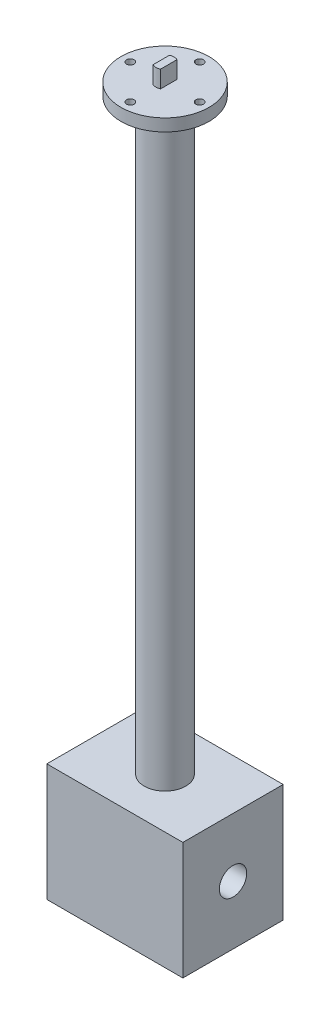
ISO-10303-21;
HEADER;
FILE_DESCRIPTION(('STEP AP214'),'2;1');
FILE_NAME('part.step','',(''),(''),'','','');
FILE_SCHEMA(('AUTOMOTIVE_DESIGN { 1 0 10303 214 1 1 1 1 }'));
ENDSEC;
DATA;
#1=APPLICATION_CONTEXT('core data for automotive mechanical design processes');
#2=APPLICATION_PROTOCOL_DEFINITION('international standard','automotive_design',2000,#1);
#3=PRODUCT_CONTEXT('',#1,'mechanical');
#4=PRODUCT('Part','Part','',(#3));
#5=PRODUCT_RELATED_PRODUCT_CATEGORY('part','',(#4));
#6=PRODUCT_DEFINITION_FORMATION('','',#4);
#7=PRODUCT_DEFINITION_CONTEXT('part definition',#1,'design');
#8=PRODUCT_DEFINITION('design','',#6,#7);
#9=PRODUCT_DEFINITION_SHAPE('','',#8);
#10=(LENGTH_UNIT() NAMED_UNIT(*) SI_UNIT(.MILLI.,.METRE.));
#11=(NAMED_UNIT(*) PLANE_ANGLE_UNIT() SI_UNIT($,.RADIAN.));
#12=(NAMED_UNIT(*) SI_UNIT($,.STERADIAN.) SOLID_ANGLE_UNIT());
#13=UNCERTAINTY_MEASURE_WITH_UNIT(LENGTH_MEASURE(1.E-05),#10,'distance_accuracy_value','');
#14=(GEOMETRIC_REPRESENTATION_CONTEXT(3) GLOBAL_UNCERTAINTY_ASSIGNED_CONTEXT((#13)) GLOBAL_UNIT_ASSIGNED_CONTEXT((#10,
#11,#12)) REPRESENTATION_CONTEXT('',''));
#15=CARTESIAN_POINT('',(0.,0.,0.));
#16=DIRECTION('',(0.,0.,1.));
#17=DIRECTION('',(1.,0.,0.));
#18=AXIS2_PLACEMENT_3D('',#15,#16,#17);
#19=CARTESIAN_POINT('',(0.,6.35,0.));
#20=DIRECTION('',(0.,1.,0.));
#21=DIRECTION('',(0.,0.,1.));
#22=AXIS2_PLACEMENT_3D('',#19,#20,#21);
#23=PLANE('',#22);
#24=CARTESIAN_POINT('',(18.,6.35,-1.88539992297529E-13));
#25=DIRECTION('',(0.,1.,0.));
#26=DIRECTION('',(0.,0.,1.));
#27=AXIS2_PLACEMENT_3D('',#24,#25,#26);
#28=CIRCLE('',#27,1.984375);
#29=CARTESIAN_POINT('',(18.,6.35,1.98437499999981));
#30=VERTEX_POINT('',#29);
#31=EDGE_CURVE('E132',#30,#30,#28,.T.);
#32=ORIENTED_EDGE('',*,*,#31,.F.);
#33=EDGE_LOOP('',(#32));
#34=FACE_BOUND('',#33,.T.);
#35=CARTESIAN_POINT('',(0.,6.35,18.));
#36=DIRECTION('',(0.,1.,0.));
#37=DIRECTION('',(0.,0.,1.));
#38=AXIS2_PLACEMENT_3D('',#35,#36,#37);
#39=CIRCLE('',#38,1.984375);
#40=CARTESIAN_POINT('',(0.,6.35,19.984375));
#41=VERTEX_POINT('',#40);
#42=EDGE_CURVE('E146',#41,#41,#39,.T.);
#43=ORIENTED_EDGE('',*,*,#42,.F.);
#44=EDGE_LOOP('',(#43));
#45=FACE_BOUND('',#44,.T.);
#46=CARTESIAN_POINT('',(-18.,6.35,0.));
#47=DIRECTION('',(0.,1.,0.));
#48=DIRECTION('',(0.,0.,1.));
#49=AXIS2_PLACEMENT_3D('',#46,#47,#48);
#50=CIRCLE('',#49,1.984375);
#51=CARTESIAN_POINT('',(-18.,6.35,1.98437500000006));
#52=VERTEX_POINT('',#51);
#53=EDGE_CURVE('E154',#52,#52,#50,.T.);
#54=ORIENTED_EDGE('',*,*,#53,.F.);
#55=EDGE_LOOP('',(#54));
#56=FACE_BOUND('',#55,.T.);
#57=CARTESIAN_POINT('',(0.,6.35,-18.));
#58=DIRECTION('',(0.,1.,0.));
#59=DIRECTION('',(0.,0.,1.));
#60=AXIS2_PLACEMENT_3D('',#57,#58,#59);
#61=CIRCLE('',#60,1.984375);
#62=CARTESIAN_POINT('',(0.,6.35,-16.015625));
#63=VERTEX_POINT('',#62);
#64=EDGE_CURVE('E162',#63,#63,#61,.T.);
#65=ORIENTED_EDGE('',*,*,#64,.F.);
#66=EDGE_LOOP('',(#65));
#67=FACE_BOUND('',#66,.T.);
#68=CARTESIAN_POINT('',(0.,6.35,0.));
#69=DIRECTION('',(0.,1.,0.));
#70=DIRECTION('',(0.,0.,1.));
#71=AXIS2_PLACEMENT_3D('',#68,#69,#70);
#72=CIRCLE('',#71,22.86);
#73=CARTESIAN_POINT('',(0.,6.35,22.86));
#74=VERTEX_POINT('',#73);
#75=EDGE_CURVE('E210',#74,#74,#72,.T.);
#76=ORIENTED_EDGE('',*,*,#75,.T.);
#77=EDGE_LOOP('',(#76));
#78=FACE_BOUND('',#77,.T.);
#79=CARTESIAN_POINT('',(0.,6.35,0.));
#80=DIRECTION('',(0.,1.,0.));
#81=DIRECTION('',(0.,0.,1.));
#82=AXIS2_PLACEMENT_3D('',#79,#80,#81);
#83=CIRCLE('',#82,4.699);
#84=CARTESIAN_POINT('',(1.9685,6.35,-4.26680310654242));
#85=VERTEX_POINT('',#84);
#86=CARTESIAN_POINT('',(-1.9685,6.35,-4.26680310654242));
#87=VERTEX_POINT('',#86);
#88=EDGE_CURVE('E187',#85,#87,#83,.T.);
#89=ORIENTED_EDGE('',*,*,#88,.F.);
#90=DIRECTION('',(0.,0.,1.));
#91=VECTOR('',#90,1.);
#92=CARTESIAN_POINT('',(1.9685,6.35,0.));
#93=LINE('',#92,#91);
#94=CARTESIAN_POINT('',(1.9685,6.35,4.26680310654242));
#95=VERTEX_POINT('',#94);
#96=EDGE_CURVE('E55',#85,#95,#93,.T.);
#97=ORIENTED_EDGE('',*,*,#96,.T.);
#98=CARTESIAN_POINT('',(-1.9685,6.35,4.26680310654241));
#99=VERTEX_POINT('',#98);
#100=EDGE_CURVE('E60',#99,#95,#83,.T.);
#101=ORIENTED_EDGE('',*,*,#100,.F.);
#102=DIRECTION('',(0.,0.,1.));
#103=VECTOR('',#102,1.);
#104=CARTESIAN_POINT('',(-1.9685,6.35,0.));
#105=LINE('',#104,#103);
#106=EDGE_CURVE('E191',#87,#99,#105,.T.);
#107=ORIENTED_EDGE('',*,*,#106,.F.);
#108=EDGE_LOOP('',(#89,#97,#101,#107));
#109=FACE_BOUND('',#108,.T.);
#110=ADVANCED_FACE('F39',(#34,#45,#56,#67,#78,#109),#23,.T.);
#111=CARTESIAN_POINT('',(0.,6.35,0.));
#112=DIRECTION('',(0.,-1.,0.));
#113=DIRECTION('',(0.,0.,-1.));
#114=AXIS2_PLACEMENT_3D('',#111,#112,#113);
#115=CYLINDRICAL_SURFACE('',#114,22.86);
#116=ORIENTED_EDGE('',*,*,#75,.F.);
#117=EDGE_LOOP('',(#116));
#118=FACE_BOUND('',#117,.T.);
#119=CARTESIAN_POINT('',(0.,0.,0.));
#120=DIRECTION('',(0.,1.,0.));
#121=DIRECTION('',(0.,0.,1.));
#122=AXIS2_PLACEMENT_3D('',#119,#120,#121);
#123=CIRCLE('',#122,22.86);
#124=CARTESIAN_POINT('',(0.,0.,22.86));
#125=VERTEX_POINT('',#124);
#126=EDGE_CURVE('E209',#125,#125,#123,.T.);
#127=ORIENTED_EDGE('',*,*,#126,.T.);
#128=EDGE_LOOP('',(#127));
#129=FACE_BOUND('',#128,.T.);
#130=ADVANCED_FACE('F237',(#118,#129),#115,.T.);
#131=CARTESIAN_POINT('',(0.,0.,0.));
#132=DIRECTION('',(0.,1.,0.));
#133=DIRECTION('',(0.,0.,1.));
#134=AXIS2_PLACEMENT_3D('',#131,#132,#133);
#135=PLANE('',#134);
#136=CARTESIAN_POINT('',(18.,0.,-1.88539992297529E-13));
#137=DIRECTION('',(0.,1.,0.));
#138=DIRECTION('',(0.,0.,1.));
#139=AXIS2_PLACEMENT_3D('',#136,#137,#138);
#140=CIRCLE('',#139,1.984375);
#141=CARTESIAN_POINT('',(18.,0.,1.98437499999981));
#142=VERTEX_POINT('',#141);
#143=EDGE_CURVE('E137',#142,#142,#140,.T.);
#144=ORIENTED_EDGE('',*,*,#143,.T.);
#145=EDGE_LOOP('',(#144));
#146=FACE_BOUND('',#145,.T.);
#147=CARTESIAN_POINT('',(0.,0.,18.));
#148=DIRECTION('',(0.,1.,0.));
#149=DIRECTION('',(0.,0.,1.));
#150=AXIS2_PLACEMENT_3D('',#147,#148,#149);
#151=CIRCLE('',#150,1.984375);
#152=CARTESIAN_POINT('',(0.,0.,19.984375));
#153=VERTEX_POINT('',#152);
#154=EDGE_CURVE('E150',#153,#153,#151,.T.);
#155=ORIENTED_EDGE('',*,*,#154,.T.);
#156=EDGE_LOOP('',(#155));
#157=FACE_BOUND('',#156,.T.);
#158=CARTESIAN_POINT('',(-18.,0.,0.));
#159=DIRECTION('',(0.,1.,0.));
#160=DIRECTION('',(0.,0.,1.));
#161=AXIS2_PLACEMENT_3D('',#158,#159,#160);
#162=CIRCLE('',#161,1.984375);
#163=CARTESIAN_POINT('',(-18.,0.,1.98437500000006));
#164=VERTEX_POINT('',#163);
#165=EDGE_CURVE('E158',#164,#164,#162,.T.);
#166=ORIENTED_EDGE('',*,*,#165,.T.);
#167=EDGE_LOOP('',(#166));
#168=FACE_BOUND('',#167,.T.);
#169=CARTESIAN_POINT('',(0.,0.,-18.));
#170=DIRECTION('',(0.,1.,0.));
#171=DIRECTION('',(0.,0.,1.));
#172=AXIS2_PLACEMENT_3D('',#169,#170,#171);
#173=CIRCLE('',#172,1.984375);
#174=CARTESIAN_POINT('',(0.,0.,-16.015625));
#175=VERTEX_POINT('',#174);
#176=EDGE_CURVE('E166',#175,#175,#173,.T.);
#177=ORIENTED_EDGE('',*,*,#176,.T.);
#178=EDGE_LOOP('',(#177));
#179=FACE_BOUND('',#178,.T.);
#180=CARTESIAN_POINT('',(0.,0.,0.));
#181=DIRECTION('',(0.,1.,0.));
#182=DIRECTION('',(0.,0.,1.));
#183=AXIS2_PLACEMENT_3D('',#180,#181,#182);
#184=CIRCLE('',#183,14.6050000000003);
#185=CARTESIAN_POINT('',(0.,0.,14.6050000000003));
#186=VERTEX_POINT('',#185);
#187=EDGE_CURVE('E11',#186,#186,#184,.T.);
#188=ORIENTED_EDGE('',*,*,#187,.T.);
#189=EDGE_LOOP('',(#188));
#190=FACE_BOUND('',#189,.T.);
#191=ORIENTED_EDGE('',*,*,#126,.F.);
#192=EDGE_LOOP('',(#191));
#193=FACE_BOUND('',#192,.T.);
#194=ADVANCED_FACE('F243',(#146,#157,#168,#179,#190,#193),#135,.F.);
#195=CARTESIAN_POINT('',(1.9685,15.24,0.));
#196=DIRECTION('',(1.,0.,0.));
#197=DIRECTION('',(0.,0.,-1.));
#198=AXIS2_PLACEMENT_3D('',#195,#196,#197);
#199=PLANE('',#198);
#200=ORIENTED_EDGE('',*,*,#96,.F.);
#201=DIRECTION('',(0.,-1.,0.));
#202=VECTOR('',#201,1.);
#203=CARTESIAN_POINT('',(1.9685,15.24,-4.26680310654242));
#204=LINE('',#203,#202);
#205=CARTESIAN_POINT('',(1.9685,15.24,-4.26680310654242));
#206=VERTEX_POINT('',#205);
#207=EDGE_CURVE('E205',#206,#85,#204,.T.);
#208=ORIENTED_EDGE('',*,*,#207,.F.);
#209=DIRECTION('',(0.,0.,1.));
#210=VECTOR('',#209,1.);
#211=CARTESIAN_POINT('',(1.9685,15.24,0.));
#212=LINE('',#211,#210);
#213=CARTESIAN_POINT('',(1.9685,15.24,4.26680310654242));
#214=VERTEX_POINT('',#213);
#215=EDGE_CURVE('E174',#206,#214,#212,.T.);
#216=ORIENTED_EDGE('',*,*,#215,.T.);
#217=DIRECTION('',(0.,-1.,0.));
#218=VECTOR('',#217,1.);
#219=CARTESIAN_POINT('',(1.9685,15.24,4.26680310654242));
#220=LINE('',#219,#218);
#221=EDGE_CURVE('E194',#214,#95,#220,.T.);
#222=ORIENTED_EDGE('',*,*,#221,.T.);
#223=EDGE_LOOP('',(#200,#208,#216,#222));
#224=FACE_BOUND('',#223,.T.);
#225=ADVANCED_FACE('F249',(#224),#199,.T.);
#226=CARTESIAN_POINT('',(0.,15.24,0.));
#227=DIRECTION('',(0.,-1.,0.));
#228=DIRECTION('',(0.,0.,-1.));
#229=AXIS2_PLACEMENT_3D('',#226,#227,#228);
#230=CYLINDRICAL_SURFACE('',#229,4.699);
#231=ORIENTED_EDGE('',*,*,#88,.T.);
#232=DIRECTION('',(0.,-1.,0.));
#233=VECTOR('',#232,1.);
#234=CARTESIAN_POINT('',(-1.9685,15.24,-4.26680310654242));
#235=LINE('',#234,#233);
#236=CARTESIAN_POINT('',(-1.9685,15.24,-4.26680310654242));
#237=VERTEX_POINT('',#236);
#238=EDGE_CURVE('E201',#237,#87,#235,.T.);
#239=ORIENTED_EDGE('',*,*,#238,.F.);
#240=CARTESIAN_POINT('',(0.,15.24,0.));
#241=DIRECTION('',(0.,1.,0.));
#242=DIRECTION('',(0.,0.,1.));
#243=AXIS2_PLACEMENT_3D('',#240,#241,#242);
#244=CIRCLE('',#243,4.699);
#245=EDGE_CURVE('E178',#206,#237,#244,.T.);
#246=ORIENTED_EDGE('',*,*,#245,.F.);
#247=ORIENTED_EDGE('',*,*,#207,.T.);
#248=EDGE_LOOP('',(#231,#239,#246,#247));
#249=FACE_BOUND('',#248,.T.);
#250=ADVANCED_FACE('F256',(#249),#230,.T.);
#251=CARTESIAN_POINT('',(-1.9685,15.24,0.));
#252=DIRECTION('',(1.,0.,0.));
#253=DIRECTION('',(0.,0.,-1.));
#254=AXIS2_PLACEMENT_3D('',#251,#252,#253);
#255=PLANE('',#254);
#256=ORIENTED_EDGE('',*,*,#106,.T.);
#257=DIRECTION('',(0.,-1.,0.));
#258=VECTOR('',#257,1.);
#259=CARTESIAN_POINT('',(-1.9685,15.24,4.26680310654241));
#260=LINE('',#259,#258);
#261=CARTESIAN_POINT('',(-1.9685,15.24,4.26680310654241));
#262=VERTEX_POINT('',#261);
#263=EDGE_CURVE('E197',#262,#99,#260,.T.);
#264=ORIENTED_EDGE('',*,*,#263,.F.);
#265=DIRECTION('',(0.,0.,1.));
#266=VECTOR('',#265,1.);
#267=CARTESIAN_POINT('',(-1.9685,15.24,0.));
#268=LINE('',#267,#266);
#269=EDGE_CURVE('E181',#237,#262,#268,.T.);
#270=ORIENTED_EDGE('',*,*,#269,.F.);
#271=ORIENTED_EDGE('',*,*,#238,.T.);
#272=EDGE_LOOP('',(#256,#264,#270,#271));
#273=FACE_BOUND('',#272,.T.);
#274=ADVANCED_FACE('F288',(#273),#255,.F.);
#275=ORIENTED_EDGE('',*,*,#100,.T.);
#276=ORIENTED_EDGE('',*,*,#221,.F.);
#277=EDGE_CURVE('E182',#262,#214,#244,.T.);
#278=ORIENTED_EDGE('',*,*,#277,.F.);
#279=ORIENTED_EDGE('',*,*,#263,.T.);
#280=EDGE_LOOP('',(#275,#276,#278,#279));
#281=FACE_BOUND('',#280,.T.);
#282=ADVANCED_FACE('F281',(#281),#230,.T.);
#283=CARTESIAN_POINT('',(0.,15.24,0.));
#284=DIRECTION('',(0.,1.,0.));
#285=DIRECTION('',(0.,0.,1.));
#286=AXIS2_PLACEMENT_3D('',#283,#284,#285);
#287=PLANE('',#286);
#288=ORIENTED_EDGE('',*,*,#215,.F.);
#289=ORIENTED_EDGE('',*,*,#245,.T.);
#290=ORIENTED_EDGE('',*,*,#269,.T.);
#291=ORIENTED_EDGE('',*,*,#277,.T.);
#292=EDGE_LOOP('',(#288,#289,#290,#291));
#293=FACE_BOUND('',#292,.T.);
#294=ADVANCED_FACE('F233',(#293),#287,.T.);
#295=CARTESIAN_POINT('',(0.,-304.8,0.));
#296=DIRECTION('',(0.,1.,0.));
#297=DIRECTION('',(0.,0.,1.));
#298=AXIS2_PLACEMENT_3D('',#295,#296,#297);
#299=CYLINDRICAL_SURFACE('',#298,10.795);
#300=CARTESIAN_POINT('',(0.,-3.81000000000037,0.));
#301=DIRECTION('',(0.,1.,0.));
#302=DIRECTION('',(0.,0.,1.));
#303=AXIS2_PLACEMENT_3D('',#300,#301,#302);
#304=CIRCLE('',#303,10.795);
#305=CARTESIAN_POINT('',(0.,-3.81000000000037,10.795));
#306=VERTEX_POINT('',#305);
#307=EDGE_CURVE('E48',#306,#306,#304,.F.);
#308=ORIENTED_EDGE('',*,*,#307,.T.);
#309=EDGE_LOOP('',(#308));
#310=FACE_BOUND('',#309,.T.);
#311=CARTESIAN_POINT('',(0.,-304.8,0.));
#312=DIRECTION('',(0.,-1.,0.));
#313=DIRECTION('',(0.,0.,-1.));
#314=AXIS2_PLACEMENT_3D('',#311,#312,#313);
#315=CIRCLE('',#314,10.795);
#316=CARTESIAN_POINT('',(0.,-304.8,-10.795));
#317=VERTEX_POINT('',#316);
#318=EDGE_CURVE('E170',#317,#317,#315,.T.);
#319=ORIENTED_EDGE('',*,*,#318,.F.);
#320=EDGE_LOOP('',(#319));
#321=FACE_BOUND('',#320,.T.);
#322=ADVANCED_FACE('F220',(#310,#321),#299,.T.);
#323=CARTESIAN_POINT('',(0.,-3.81000000000031,0.));
#324=DIRECTION('',(0.,1.,0.));
#325=DIRECTION('',(0.,0.,1.));
#326=AXIS2_PLACEMENT_3D('',#323,#324,#325);
#327=CONICAL_SURFACE('',#326,10.795,0.785398163397448);
#328=ORIENTED_EDGE('',*,*,#187,.F.);
#329=EDGE_LOOP('',(#328));
#330=FACE_BOUND('',#329,.T.);
#331=ORIENTED_EDGE('',*,*,#307,.F.);
#332=EDGE_LOOP('',(#331));
#333=FACE_BOUND('',#332,.T.);
#334=ADVANCED_FACE('F41',(#330,#333),#327,.T.);
#335=CARTESIAN_POINT('',(0.,6.35,-18.));
#336=DIRECTION('',(0.,1.,0.));
#337=DIRECTION('',(0.,0.,1.));
#338=AXIS2_PLACEMENT_3D('',#335,#336,#337);
#339=CYLINDRICAL_SURFACE('',#338,1.984375);
#340=ORIENTED_EDGE('',*,*,#176,.F.);
#341=EDGE_LOOP('',(#340));
#342=FACE_BOUND('',#341,.T.);
#343=ORIENTED_EDGE('',*,*,#64,.T.);
#344=EDGE_LOOP('',(#343));
#345=FACE_BOUND('',#344,.T.);
#346=ADVANCED_FACE('F224',(#342,#345),#339,.F.);
#347=CARTESIAN_POINT('',(-18.,6.35,0.));
#348=DIRECTION('',(0.,1.,0.));
#349=DIRECTION('',(0.,0.,1.));
#350=AXIS2_PLACEMENT_3D('',#347,#348,#349);
#351=CYLINDRICAL_SURFACE('',#350,1.984375);
#352=ORIENTED_EDGE('',*,*,#165,.F.);
#353=EDGE_LOOP('',(#352));
#354=FACE_BOUND('',#353,.T.);
#355=ORIENTED_EDGE('',*,*,#53,.T.);
#356=EDGE_LOOP('',(#355));
#357=FACE_BOUND('',#356,.T.);
#358=ADVANCED_FACE('F230',(#354,#357),#351,.F.);
#359=CARTESIAN_POINT('',(0.,6.35,18.));
#360=DIRECTION('',(0.,1.,0.));
#361=DIRECTION('',(0.,0.,1.));
#362=AXIS2_PLACEMENT_3D('',#359,#360,#361);
#363=CYLINDRICAL_SURFACE('',#362,1.984375);
#364=ORIENTED_EDGE('',*,*,#154,.F.);
#365=EDGE_LOOP('',(#364));
#366=FACE_BOUND('',#365,.T.);
#367=ORIENTED_EDGE('',*,*,#42,.T.);
#368=EDGE_LOOP('',(#367));
#369=FACE_BOUND('',#368,.T.);
#370=ADVANCED_FACE('F300',(#366,#369),#363,.F.);
#371=CARTESIAN_POINT('',(18.,6.35,-1.88539992297529E-13));
#372=DIRECTION('',(0.,1.,0.));
#373=DIRECTION('',(0.,0.,1.));
#374=AXIS2_PLACEMENT_3D('',#371,#372,#373);
#375=CYLINDRICAL_SURFACE('',#374,1.984375);
#376=ORIENTED_EDGE('',*,*,#143,.F.);
#377=EDGE_LOOP('',(#376));
#378=FACE_BOUND('',#377,.T.);
#379=ORIENTED_EDGE('',*,*,#31,.T.);
#380=EDGE_LOOP('',(#379));
#381=FACE_BOUND('',#380,.T.);
#382=ADVANCED_FACE('F304',(#378,#381),#375,.F.);
#383=CARTESIAN_POINT('',(-35.306,-365.76,26.035));
#384=DIRECTION('',(1.,0.,0.));
#385=DIRECTION('',(0.,0.,-1.));
#386=AXIS2_PLACEMENT_3D('',#383,#384,#385);
#387=PLANE('',#386);
#388=CARTESIAN_POINT('',(-35.306,-335.28,0.));
#389=DIRECTION('',(1.,0.,0.));
#390=DIRECTION('',(0.,0.,-1.));
#391=AXIS2_PLACEMENT_3D('',#388,#389,#390);
#392=CIRCLE('',#391,7.11199999999999);
#393=CARTESIAN_POINT('',(-35.306,-335.28,-7.112));
#394=VERTEX_POINT('',#393);
#395=EDGE_CURVE('E336',#394,#394,#392,.T.);
#396=ORIENTED_EDGE('',*,*,#395,.T.);
#397=EDGE_LOOP('',(#396));
#398=FACE_BOUND('',#397,.T.);
#399=DIRECTION('',(0.,0.,-1.));
#400=VECTOR('',#399,1.);
#401=CARTESIAN_POINT('',(-35.306,-304.8,26.035));
#402=LINE('',#401,#400);
#403=CARTESIAN_POINT('',(-35.306,-304.8,26.035));
#404=VERTEX_POINT('',#403);
#405=CARTESIAN_POINT('',(-35.306,-304.8,-26.035));
#406=VERTEX_POINT('',#405);
#407=EDGE_CURVE('E130',#404,#406,#402,.T.);
#408=ORIENTED_EDGE('',*,*,#407,.T.);
#409=DIRECTION('',(0.,1.,0.));
#410=VECTOR('',#409,1.);
#411=CARTESIAN_POINT('',(-35.306,-365.76,-26.035));
#412=LINE('',#411,#410);
#413=CARTESIAN_POINT('',(-35.306,-365.76,-26.035));
#414=VERTEX_POINT('',#413);
#415=EDGE_CURVE('E108',#414,#406,#412,.T.);
#416=ORIENTED_EDGE('',*,*,#415,.F.);
#417=DIRECTION('',(0.,0.,-1.));
#418=VECTOR('',#417,1.);
#419=CARTESIAN_POINT('',(-35.306,-365.76,26.035));
#420=LINE('',#419,#418);
#421=CARTESIAN_POINT('',(-35.306,-365.76,26.035));
#422=VERTEX_POINT('',#421);
#423=EDGE_CURVE('E116',#422,#414,#420,.T.);
#424=ORIENTED_EDGE('',*,*,#423,.F.);
#425=DIRECTION('',(0.,1.,0.));
#426=VECTOR('',#425,1.);
#427=CARTESIAN_POINT('',(-35.306,-365.76,26.035));
#428=LINE('',#427,#426);
#429=EDGE_CURVE('E349',#422,#404,#428,.T.);
#430=ORIENTED_EDGE('',*,*,#429,.T.);
#431=EDGE_LOOP('',(#408,#416,#424,#430));
#432=FACE_BOUND('',#431,.T.);
#433=ADVANCED_FACE('F128',(#398,#432),#387,.F.);
#434=CARTESIAN_POINT('',(-35.306,-365.76,-26.035));
#435=DIRECTION('',(0.,0.,1.));
#436=DIRECTION('',(1.,0.,0.));
#437=AXIS2_PLACEMENT_3D('',#434,#435,#436);
#438=PLANE('',#437);
#439=DIRECTION('',(1.,0.,0.));
#440=VECTOR('',#439,1.);
#441=CARTESIAN_POINT('',(-35.306,-304.8,-26.035));
#442=LINE('',#441,#440);
#443=CARTESIAN_POINT('',(35.306,-304.8,-26.035));
#444=VERTEX_POINT('',#443);
#445=EDGE_CURVE('E352',#406,#444,#442,.T.);
#446=ORIENTED_EDGE('',*,*,#445,.T.);
#447=DIRECTION('',(0.,1.,0.));
#448=VECTOR('',#447,1.);
#449=CARTESIAN_POINT('',(35.306,-365.76,-26.035));
#450=LINE('',#449,#448);
#451=CARTESIAN_POINT('',(35.306,-365.76,-26.035));
#452=VERTEX_POINT('',#451);
#453=EDGE_CURVE('E111',#452,#444,#450,.T.);
#454=ORIENTED_EDGE('',*,*,#453,.F.);
#455=DIRECTION('',(1.,0.,0.));
#456=VECTOR('',#455,1.);
#457=CARTESIAN_POINT('',(-35.306,-365.76,-26.035));
#458=LINE('',#457,#456);
#459=EDGE_CURVE('E104',#414,#452,#458,.T.);
#460=ORIENTED_EDGE('',*,*,#459,.F.);
#461=ORIENTED_EDGE('',*,*,#415,.T.);
#462=EDGE_LOOP('',(#446,#454,#460,#461));
#463=FACE_BOUND('',#462,.T.);
#464=ADVANCED_FACE('F106',(#463),#438,.F.);
#465=CARTESIAN_POINT('',(35.306,-365.76,26.035));
#466=DIRECTION('',(-1.,0.,0.));
#467=DIRECTION('',(0.,0.,1.));
#468=AXIS2_PLACEMENT_3D('',#465,#466,#467);
#469=PLANE('',#468);
#470=CARTESIAN_POINT('',(35.306,-335.28,0.));
#471=DIRECTION('',(1.,0.,0.));
#472=DIRECTION('',(0.,0.,-1.));
#473=AXIS2_PLACEMENT_3D('',#470,#471,#472);
#474=CIRCLE('',#473,7.11199999999999);
#475=CARTESIAN_POINT('',(35.306,-335.28,-7.112));
#476=VERTEX_POINT('',#475);
#477=EDGE_CURVE('E339',#476,#476,#474,.T.);
#478=ORIENTED_EDGE('',*,*,#477,.F.);
#479=EDGE_LOOP('',(#478));
#480=FACE_BOUND('',#479,.T.);
#481=DIRECTION('',(0.,0.,1.));
#482=VECTOR('',#481,1.);
#483=CARTESIAN_POINT('',(35.306,-304.8,26.035));
#484=LINE('',#483,#482);
#485=CARTESIAN_POINT('',(35.306,-304.8,26.035));
#486=VERTEX_POINT('',#485);
#487=EDGE_CURVE('E355',#444,#486,#484,.T.);
#488=ORIENTED_EDGE('',*,*,#487,.T.);
#489=DIRECTION('',(0.,1.,0.));
#490=VECTOR('',#489,1.);
#491=CARTESIAN_POINT('',(35.306,-365.76,26.035));
#492=LINE('',#491,#490);
#493=CARTESIAN_POINT('',(35.306,-365.76,26.035));
#494=VERTEX_POINT('',#493);
#495=EDGE_CURVE('E139',#494,#486,#492,.T.);
#496=ORIENTED_EDGE('',*,*,#495,.F.);
#497=DIRECTION('',(0.,0.,1.));
#498=VECTOR('',#497,1.);
#499=CARTESIAN_POINT('',(35.306,-365.76,26.035));
#500=LINE('',#499,#498);
#501=EDGE_CURVE('E115',#452,#494,#500,.T.);
#502=ORIENTED_EDGE('',*,*,#501,.F.);
#503=ORIENTED_EDGE('',*,*,#453,.T.);
#504=EDGE_LOOP('',(#488,#496,#502,#503));
#505=FACE_BOUND('',#504,.T.);
#506=ADVANCED_FACE('F314',(#480,#505),#469,.F.);
#507=CARTESIAN_POINT('',(-35.306,-365.76,26.035));
#508=DIRECTION('',(0.,0.,-1.));
#509=DIRECTION('',(-1.,0.,0.));
#510=AXIS2_PLACEMENT_3D('',#507,#508,#509);
#511=PLANE('',#510);
#512=DIRECTION('',(-1.,0.,0.));
#513=VECTOR('',#512,1.);
#514=CARTESIAN_POINT('',(-35.306,-304.8,26.035));
#515=LINE('',#514,#513);
#516=EDGE_CURVE('E126',#486,#404,#515,.T.);
#517=ORIENTED_EDGE('',*,*,#516,.T.);
#518=ORIENTED_EDGE('',*,*,#429,.F.);
#519=DIRECTION('',(-1.,0.,0.));
#520=VECTOR('',#519,1.);
#521=CARTESIAN_POINT('',(-35.306,-365.76,26.035));
#522=LINE('',#521,#520);
#523=EDGE_CURVE('E121',#494,#422,#522,.T.);
#524=ORIENTED_EDGE('',*,*,#523,.F.);
#525=ORIENTED_EDGE('',*,*,#495,.T.);
#526=EDGE_LOOP('',(#517,#518,#524,#525));
#527=FACE_BOUND('',#526,.T.);
#528=ADVANCED_FACE('F317',(#527),#511,.F.);
#529=CARTESIAN_POINT('',(0.,-365.76,0.));
#530=DIRECTION('',(0.,-1.,0.));
#531=DIRECTION('',(0.,0.,-1.));
#532=AXIS2_PLACEMENT_3D('',#529,#530,#531);
#533=PLANE('',#532);
#534=ORIENTED_EDGE('',*,*,#423,.T.);
#535=ORIENTED_EDGE('',*,*,#459,.T.);
#536=ORIENTED_EDGE('',*,*,#501,.T.);
#537=ORIENTED_EDGE('',*,*,#523,.T.);
#538=EDGE_LOOP('',(#534,#535,#536,#537));
#539=FACE_BOUND('',#538,.T.);
#540=ADVANCED_FACE('F119',(#539),#533,.T.);
#541=CARTESIAN_POINT('',(0.,-304.8,0.));
#542=DIRECTION('',(0.,-1.,0.));
#543=DIRECTION('',(0.,0.,-1.));
#544=AXIS2_PLACEMENT_3D('',#541,#542,#543);
#545=PLANE('',#544);
#546=ORIENTED_EDGE('',*,*,#318,.T.);
#547=EDGE_LOOP('',(#546));
#548=FACE_BOUND('',#547,.T.);
#549=ORIENTED_EDGE('',*,*,#407,.F.);
#550=ORIENTED_EDGE('',*,*,#516,.F.);
#551=ORIENTED_EDGE('',*,*,#487,.F.);
#552=ORIENTED_EDGE('',*,*,#445,.F.);
#553=EDGE_LOOP('',(#549,#550,#551,#552));
#554=FACE_BOUND('',#553,.T.);
#555=ADVANCED_FACE('F322',(#548,#554),#545,.F.);
#556=CARTESIAN_POINT('',(-35.306,-335.28,0.));
#557=DIRECTION('',(1.,0.,0.));
#558=DIRECTION('',(0.,0.,-1.));
#559=AXIS2_PLACEMENT_3D('',#556,#557,#558);
#560=CYLINDRICAL_SURFACE('',#559,7.11199999999999);
#561=ORIENTED_EDGE('',*,*,#395,.F.);
#562=EDGE_LOOP('',(#561));
#563=FACE_BOUND('',#562,.T.);
#564=ORIENTED_EDGE('',*,*,#477,.T.);
#565=EDGE_LOOP('',(#564));
#566=FACE_BOUND('',#565,.T.);
#567=ADVANCED_FACE('F325',(#563,#566),#560,.F.);
#568=CLOSED_SHELL('',(#110,#130,#194,#225,#250,#274,#282,#294,#322,#334,#346,#358,#370,#382,
#433,#464,#506,#528,#540,#555,#567));
#569=MANIFOLD_SOLID_BREP('B2',#568);
#570=ADVANCED_BREP_SHAPE_REPRESENTATION('',(#18,#569),#14);
#571=SHAPE_DEFINITION_REPRESENTATION(#9,#570);
ENDSEC;
END-ISO-10303-21;
